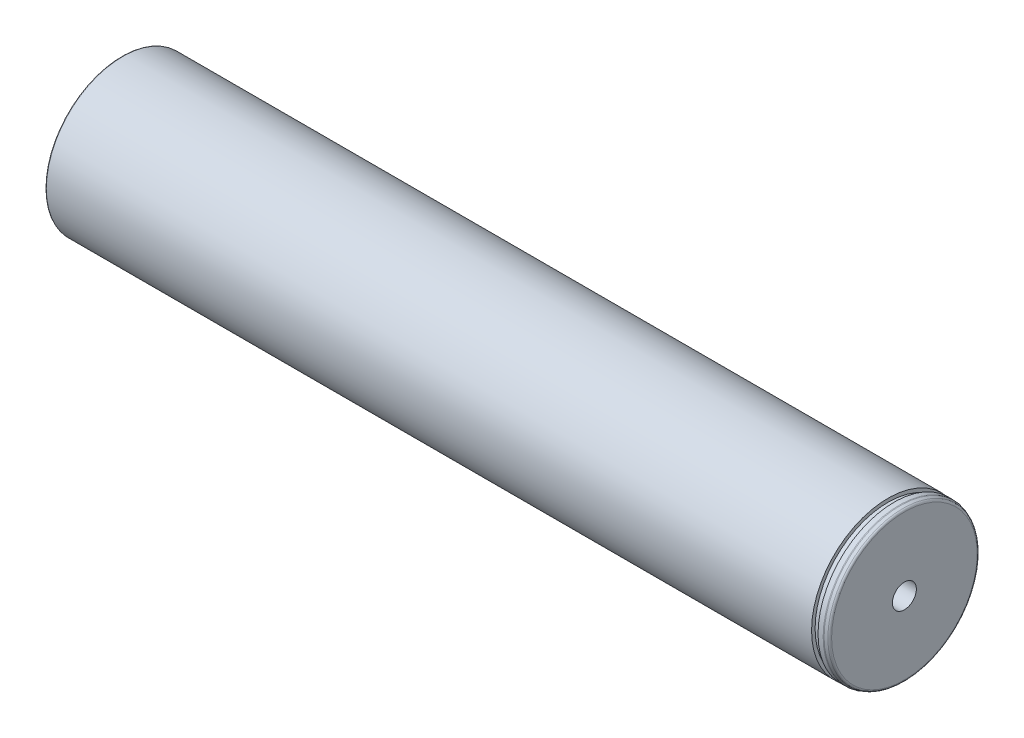
ISO-10303-21;
HEADER;
FILE_DESCRIPTION(('STEP AP214'),'2;1');
FILE_NAME('part.step','',(''),(''),'','','');
FILE_SCHEMA(('AUTOMOTIVE_DESIGN { 1 0 10303 214 1 1 1 1 }'));
ENDSEC;
DATA;
#1=APPLICATION_CONTEXT('core data for automotive mechanical design processes');
#2=APPLICATION_PROTOCOL_DEFINITION('international standard','automotive_design',2000,#1);
#3=PRODUCT_CONTEXT('',#1,'mechanical');
#4=PRODUCT('Part','Part','',(#3));
#5=PRODUCT_RELATED_PRODUCT_CATEGORY('part','',(#4));
#6=PRODUCT_DEFINITION_FORMATION('','',#4);
#7=PRODUCT_DEFINITION_CONTEXT('part definition',#1,'design');
#8=PRODUCT_DEFINITION('design','',#6,#7);
#9=PRODUCT_DEFINITION_SHAPE('','',#8);
#10=(LENGTH_UNIT() NAMED_UNIT(*) SI_UNIT(.MILLI.,.METRE.));
#11=(NAMED_UNIT(*) PLANE_ANGLE_UNIT() SI_UNIT($,.RADIAN.));
#12=(NAMED_UNIT(*) SI_UNIT($,.STERADIAN.) SOLID_ANGLE_UNIT());
#13=UNCERTAINTY_MEASURE_WITH_UNIT(LENGTH_MEASURE(1.E-05),#10,'distance_accuracy_value','');
#14=(GEOMETRIC_REPRESENTATION_CONTEXT(3) GLOBAL_UNCERTAINTY_ASSIGNED_CONTEXT((#13)) GLOBAL_UNIT_ASSIGNED_CONTEXT((#10,
#11,#12)) REPRESENTATION_CONTEXT('',''));
#15=CARTESIAN_POINT('',(0.,0.,0.));
#16=DIRECTION('',(0.,0.,1.));
#17=DIRECTION('',(1.,0.,0.));
#18=AXIS2_PLACEMENT_3D('',#15,#16,#17);
#19=CARTESIAN_POINT('',(-163.4,2.22044604925031E-13,-1.66533453693773E-13));
#20=DIRECTION('',(-1.,0.,0.));
#21=DIRECTION('',(0.,0.,1.));
#22=AXIS2_PLACEMENT_3D('',#19,#20,#21);
#23=TOROIDAL_SURFACE('',#22,28.4000000000005,0.400000000000005);
#24=CARTESIAN_POINT('',(-163.,0.,-1.11022302462516E-13));
#25=DIRECTION('',(-1.,0.,0.));
#26=DIRECTION('',(0.,0.,1.));
#27=AXIS2_PLACEMENT_3D('',#24,#25,#26);
#28=CIRCLE('',#27,28.4000000000005);
#29=CARTESIAN_POINT('',(-163.,0.,28.4000000000004));
#30=VERTEX_POINT('',#29);
#31=EDGE_CURVE('E110',#30,#30,#28,.T.);
#32=ORIENTED_EDGE('',*,*,#31,.T.);
#33=EDGE_LOOP('',(#32));
#34=FACE_BOUND('',#33,.T.);
#35=CARTESIAN_POINT('',(-163.4,2.22044604925031E-13,-1.66533453693773E-13));
#36=DIRECTION('',(-1.,0.,0.));
#37=DIRECTION('',(0.,0.,1.));
#38=AXIS2_PLACEMENT_3D('',#35,#36,#37);
#39=CIRCLE('',#38,28.0000000000005);
#40=CARTESIAN_POINT('',(-163.4,2.20490292690556E-13,28.0000000000004));
#41=VERTEX_POINT('',#40);
#42=EDGE_CURVE('E11',#41,#41,#39,.T.);
#43=ORIENTED_EDGE('',*,*,#42,.F.);
#44=EDGE_LOOP('',(#43));
#45=FACE_BOUND('',#44,.T.);
#46=ADVANCED_FACE('F47',(#34,#45),#23,.F.);
#47=CARTESIAN_POINT('',(-168.,0.,-1.11022302462516E-13));
#48=DIRECTION('',(-1.,0.,0.));
#49=DIRECTION('',(0.,0.,1.));
#50=AXIS2_PLACEMENT_3D('',#47,#48,#49);
#51=CYLINDRICAL_SURFACE('',#50,28.0000000000005);
#52=CARTESIAN_POINT('',(-164.,0.,-1.11022302462516E-13));
#53=DIRECTION('',(-1.,0.,0.));
#54=DIRECTION('',(0.,0.,1.));
#55=AXIS2_PLACEMENT_3D('',#52,#53,#54);
#56=CIRCLE('',#55,28.0000000000005);
#57=CARTESIAN_POINT('',(-164.,0.,28.0000000000004));
#58=VERTEX_POINT('',#57);
#59=EDGE_CURVE('E54',#58,#58,#56,.T.);
#60=ORIENTED_EDGE('',*,*,#59,.F.);
#61=EDGE_LOOP('',(#60));
#62=FACE_BOUND('',#61,.T.);
#63=ORIENTED_EDGE('',*,*,#42,.T.);
#64=EDGE_LOOP('',(#63));
#65=FACE_BOUND('',#64,.T.);
#66=ADVANCED_FACE('F99',(#62,#65),#51,.T.);
#67=CARTESIAN_POINT('',(-164.,28.0000000000007,-3.33066907387547E-13));
#68=DIRECTION('',(1.,0.,0.));
#69=DIRECTION('',(0.,0.,-1.));
#70=AXIS2_PLACEMENT_3D('',#67,#68,#69);
#71=PLANE('',#70);
#72=CARTESIAN_POINT('',(-164.,0.,-1.11022302462516E-13));
#73=DIRECTION('',(-1.,0.,0.));
#74=DIRECTION('',(0.,0.,1.));
#75=AXIS2_PLACEMENT_3D('',#72,#73,#74);
#76=CIRCLE('',#75,25.2309401076756);
#77=CARTESIAN_POINT('',(-164.,0.,25.2309401076755));
#78=VERTEX_POINT('',#77);
#79=EDGE_CURVE('E92',#78,#78,#76,.T.);
#80=ORIENTED_EDGE('',*,*,#79,.F.);
#81=EDGE_LOOP('',(#80));
#82=FACE_BOUND('',#81,.T.);
#83=ORIENTED_EDGE('',*,*,#59,.T.);
#84=EDGE_LOOP('',(#83));
#85=FACE_BOUND('',#84,.T.);
#86=ADVANCED_FACE('F97',(#82,#85),#71,.F.);
#87=CARTESIAN_POINT('',(-164.4,0.,-1.11022302462516E-13));
#88=DIRECTION('',(-1.,0.,0.));
#89=DIRECTION('',(0.,0.,1.));
#90=AXIS2_PLACEMENT_3D('',#87,#88,#89);
#91=TOROIDAL_SURFACE('',#90,25.2309401076756,0.399999999999999);
#92=ORIENTED_EDGE('',*,*,#79,.T.);
#93=EDGE_LOOP('',(#92));
#94=FACE_BOUND('',#93,.T.);
#95=CARTESIAN_POINT('',(-164.2,2.22044604925031E-13,-1.66533453693773E-13));
#96=DIRECTION('',(-1.,0.,0.));
#97=DIRECTION('',(0.,0.,1.));
#98=AXIS2_PLACEMENT_3D('',#95,#96,#97);
#99=CIRCLE('',#98,24.884529946162);
#100=CARTESIAN_POINT('',(-164.2,2.20663236019871E-13,24.8845299461618));
#101=VERTEX_POINT('',#100);
#102=EDGE_CURVE('E89',#101,#101,#99,.T.);
#103=ORIENTED_EDGE('',*,*,#102,.F.);
#104=EDGE_LOOP('',(#103));
#105=FACE_BOUND('',#104,.T.);
#106=ADVANCED_FACE('F177',(#94,#105),#91,.F.);
#107=CARTESIAN_POINT('',(-164.2,2.22044604925031E-13,-1.66533453693773E-13));
#108=DIRECTION('',(1.,0.,0.));
#109=DIRECTION('',(0.,0.,-1.));
#110=AXIS2_PLACEMENT_3D('',#107,#108,#109);
#111=CONICAL_SURFACE('',#110,24.884529946162,0.523598775599148);
#112=CARTESIAN_POINT('',(-167.8,0.,-1.11022302462516E-13));
#113=DIRECTION('',(-1.,0.,0.));
#114=DIRECTION('',(0.,0.,1.));
#115=AXIS2_PLACEMENT_3D('',#112,#113,#114);
#116=CIRCLE('',#115,22.8060689770749);
#117=CARTESIAN_POINT('',(-167.8,0.,22.8060689770748));
#118=VERTEX_POINT('',#117);
#119=EDGE_CURVE('E86',#118,#118,#116,.T.);
#120=ORIENTED_EDGE('',*,*,#119,.F.);
#121=EDGE_LOOP('',(#120));
#122=FACE_BOUND('',#121,.T.);
#123=ORIENTED_EDGE('',*,*,#102,.T.);
#124=EDGE_LOOP('',(#123));
#125=FACE_BOUND('',#124,.T.);
#126=ADVANCED_FACE('F173',(#122,#125),#111,.T.);
#127=CARTESIAN_POINT('',(-167.6,2.22044604925031E-13,-1.66533453693773E-13));
#128=DIRECTION('',(-1.,0.,0.));
#129=DIRECTION('',(0.,0.,1.));
#130=AXIS2_PLACEMENT_3D('',#127,#128,#129);
#131=TOROIDAL_SURFACE('',#130,22.4596588155613,0.400000000000012);
#132=CARTESIAN_POINT('',(-168.,0.,-1.11022302462516E-13));
#133=DIRECTION('',(-1.,0.,0.));
#134=DIRECTION('',(0.,0.,1.));
#135=AXIS2_PLACEMENT_3D('',#132,#133,#134);
#136=CIRCLE('',#135,22.4596588155613);
#137=CARTESIAN_POINT('',(-168.,0.,22.4596588155612));
#138=VERTEX_POINT('',#137);
#139=EDGE_CURVE('E83',#138,#138,#136,.T.);
#140=ORIENTED_EDGE('',*,*,#139,.F.);
#141=EDGE_LOOP('',(#140));
#142=FACE_BOUND('',#141,.T.);
#143=ORIENTED_EDGE('',*,*,#119,.T.);
#144=EDGE_LOOP('',(#143));
#145=FACE_BOUND('',#144,.T.);
#146=ADVANCED_FACE('F169',(#142,#145),#131,.T.);
#147=CARTESIAN_POINT('',(-168.,22.4596588155612,-1.66533453693773E-13));
#148=DIRECTION('',(1.,0.,0.));
#149=DIRECTION('',(0.,0.,-1.));
#150=AXIS2_PLACEMENT_3D('',#147,#148,#149);
#151=PLANE('',#150);
#152=CARTESIAN_POINT('',(-168.,0.,-1.11022302462516E-13));
#153=DIRECTION('',(-1.,0.,0.));
#154=DIRECTION('',(0.,0.,1.));
#155=AXIS2_PLACEMENT_3D('',#152,#153,#154);
#156=CIRCLE('',#155,5.1);
#157=CARTESIAN_POINT('',(-168.,0.,5.09999999999989));
#158=VERTEX_POINT('',#157);
#159=EDGE_CURVE('E74',#158,#158,#156,.T.);
#160=ORIENTED_EDGE('',*,*,#159,.F.);
#161=EDGE_LOOP('',(#160));
#162=FACE_BOUND('',#161,.T.);
#163=ORIENTED_EDGE('',*,*,#139,.T.);
#164=EDGE_LOOP('',(#163));
#165=FACE_BOUND('',#164,.T.);
#166=ADVANCED_FACE('F165',(#162,#165),#151,.F.);
#167=CARTESIAN_POINT('',(-168.,0.,-1.11022302462516E-13));
#168=DIRECTION('',(-1.,0.,0.));
#169=DIRECTION('',(0.,0.,1.));
#170=AXIS2_PLACEMENT_3D('',#167,#168,#169);
#171=CYLINDRICAL_SURFACE('',#170,5.1);
#172=CARTESIAN_POINT('',(-148.,0.,-1.11022302462516E-13));
#173=DIRECTION('',(-1.,0.,0.));
#174=DIRECTION('',(0.,0.,1.));
#175=AXIS2_PLACEMENT_3D('',#172,#173,#174);
#176=CIRCLE('',#175,5.1);
#177=CARTESIAN_POINT('',(-148.,0.,5.09999999999989));
#178=VERTEX_POINT('',#177);
#179=EDGE_CURVE('E70',#178,#178,#176,.T.);
#180=ORIENTED_EDGE('',*,*,#179,.F.);
#181=EDGE_LOOP('',(#180));
#182=FACE_BOUND('',#181,.T.);
#183=ORIENTED_EDGE('',*,*,#159,.T.);
#184=EDGE_LOOP('',(#183));
#185=FACE_BOUND('',#184,.T.);
#186=ADVANCED_FACE('F162',(#182,#185),#171,.F.);
#187=CARTESIAN_POINT('',(-148.,0.,-1.11022302462516E-13));
#188=DIRECTION('',(-1.,0.,0.));
#189=DIRECTION('',(0.,0.,1.));
#190=AXIS2_PLACEMENT_3D('',#187,#188,#189);
#191=CONICAL_SURFACE('',#190,5.1,1.0471975511966);
#192=CARTESIAN_POINT('',(-145.055513627133,0.,0.));
#193=VERTEX_POINT('',#192);
#194=VERTEX_LOOP('',#193);
#195=FACE_BOUND('',#194,.T.);
#196=ORIENTED_EDGE('',*,*,#179,.T.);
#197=EDGE_LOOP('',(#196));
#198=FACE_BOUND('',#197,.T.);
#199=ADVANCED_FACE('F64',(#195,#198),#191,.F.);
#200=CARTESIAN_POINT('',(150.,0.,-1.11022302462516E-13));
#201=DIRECTION('',(1.,0.,0.));
#202=DIRECTION('',(0.,0.,-1.));
#203=AXIS2_PLACEMENT_3D('',#200,#201,#202);
#204=CONICAL_SURFACE('',#203,5.1,1.04719755119659);
#205=CARTESIAN_POINT('',(147.055513627133,0.,0.));
#206=VERTEX_POINT('',#205);
#207=VERTEX_LOOP('',#206);
#208=FACE_BOUND('',#207,.T.);
#209=CARTESIAN_POINT('',(150.,0.,-1.11022302462516E-13));
#210=DIRECTION('',(-1.,0.,0.));
#211=DIRECTION('',(0.,0.,1.));
#212=AXIS2_PLACEMENT_3D('',#209,#210,#211);
#213=CIRCLE('',#212,5.1);
#214=CARTESIAN_POINT('',(150.,0.,5.09999999999989));
#215=VERTEX_POINT('',#214);
#216=EDGE_CURVE('E68',#215,#215,#213,.T.);
#217=ORIENTED_EDGE('',*,*,#216,.F.);
#218=EDGE_LOOP('',(#217));
#219=FACE_BOUND('',#218,.T.);
#220=ADVANCED_FACE('F60',(#208,#219),#204,.F.);
#221=CARTESIAN_POINT('',(-168.,0.,-1.11022302462516E-13));
#222=DIRECTION('',(-1.,0.,0.));
#223=DIRECTION('',(0.,0.,1.));
#224=AXIS2_PLACEMENT_3D('',#221,#222,#223);
#225=CYLINDRICAL_SURFACE('',#224,5.1);
#226=ORIENTED_EDGE('',*,*,#216,.T.);
#227=EDGE_LOOP('',(#226));
#228=FACE_BOUND('',#227,.T.);
#229=CARTESIAN_POINT('',(170.,0.,-1.11022302462516E-13));
#230=DIRECTION('',(-1.,0.,0.));
#231=DIRECTION('',(0.,0.,1.));
#232=AXIS2_PLACEMENT_3D('',#229,#230,#231);
#233=CIRCLE('',#232,5.1);
#234=CARTESIAN_POINT('',(170.,0.,5.09999999999989));
#235=VERTEX_POINT('',#234);
#236=EDGE_CURVE('E71',#235,#235,#233,.T.);
#237=ORIENTED_EDGE('',*,*,#236,.F.);
#238=EDGE_LOOP('',(#237));
#239=FACE_BOUND('',#238,.T.);
#240=ADVANCED_FACE('F63',(#228,#239),#225,.F.);
#241=CARTESIAN_POINT('',(170.,30.971851993258,-3.88578058618805E-13));
#242=DIRECTION('',(1.,0.,0.));
#243=DIRECTION('',(0.,0.,-1.));
#244=AXIS2_PLACEMENT_3D('',#241,#242,#243);
#245=PLANE('',#244);
#246=ORIENTED_EDGE('',*,*,#236,.T.);
#247=EDGE_LOOP('',(#246));
#248=FACE_BOUND('',#247,.T.);
#249=CARTESIAN_POINT('',(170.,0.,-1.11022302462516E-13));
#250=DIRECTION('',(-1.,0.,0.));
#251=DIRECTION('',(0.,0.,1.));
#252=AXIS2_PLACEMENT_3D('',#249,#250,#251);
#253=CIRCLE('',#252,30.9718519932579);
#254=CARTESIAN_POINT('',(170.,0.,30.9718519932578));
#255=VERTEX_POINT('',#254);
#256=EDGE_CURVE('E77',#255,#255,#253,.T.);
#257=ORIENTED_EDGE('',*,*,#256,.F.);
#258=EDGE_LOOP('',(#257));
#259=FACE_BOUND('',#258,.T.);
#260=ADVANCED_FACE('F145',(#248,#259),#245,.T.);
#261=CARTESIAN_POINT('',(169.,-2.22044604925031E-13,-4.9960036108132E-13));
#262=DIRECTION('',(-1.,0.,0.));
#263=DIRECTION('',(0.,0.,1.));
#264=AXIS2_PLACEMENT_3D('',#261,#262,#263);
#265=TOROIDAL_SURFACE('',#264,30.9718519932579,0.999999999999993);
#266=CARTESIAN_POINT('',(169.342020143326,0.,-1.11022302462516E-13));
#267=DIRECTION('',(-1.,0.,0.));
#268=DIRECTION('',(0.,0.,1.));
#269=AXIS2_PLACEMENT_3D('',#266,#267,#268);
#270=CIRCLE('',#269,31.9115446140438);
#271=CARTESIAN_POINT('',(169.342020143326,0.,31.9115446140437));
#272=VERTEX_POINT('',#271);
#273=EDGE_CURVE('E138',#272,#272,#270,.T.);
#274=ORIENTED_EDGE('',*,*,#273,.F.);
#275=EDGE_LOOP('',(#274));
#276=FACE_BOUND('',#275,.T.);
#277=ORIENTED_EDGE('',*,*,#256,.T.);
#278=EDGE_LOOP('',(#277));
#279=FACE_BOUND('',#278,.T.);
#280=ADVANCED_FACE('F143',(#276,#279),#265,.T.);
#281=CARTESIAN_POINT('',(169.342020143326,0.,-1.11022302462516E-13));
#282=DIRECTION('',(-1.,0.,0.));
#283=DIRECTION('',(0.,0.,1.));
#284=AXIS2_PLACEMENT_3D('',#281,#282,#283);
#285=CONICAL_SURFACE('',#284,31.9115446140438,0.349065850398858);
#286=CARTESIAN_POINT('',(168.165693162617,0.,-1.11022302462516E-13));
#287=DIRECTION('',(-1.,0.,0.));
#288=DIRECTION('',(0.,0.,1.));
#289=AXIS2_PLACEMENT_3D('',#286,#287,#288);
#290=CIRCLE('',#289,32.3396926207859);
#291=CARTESIAN_POINT('',(168.165693162617,0.,32.3396926207858));
#292=VERTEX_POINT('',#291);
#293=EDGE_CURVE('E135',#292,#292,#290,.T.);
#294=ORIENTED_EDGE('',*,*,#293,.F.);
#295=EDGE_LOOP('',(#294));
#296=FACE_BOUND('',#295,.T.);
#297=ORIENTED_EDGE('',*,*,#273,.T.);
#298=EDGE_LOOP('',(#297));
#299=FACE_BOUND('',#298,.T.);
#300=ADVANCED_FACE('F153',(#296,#299),#285,.T.);
#301=CARTESIAN_POINT('',(167.823673019291,0.,0.));
#302=DIRECTION('',(-1.,0.,0.));
#303=DIRECTION('',(0.,0.,1.));
#304=AXIS2_PLACEMENT_3D('',#301,#302,#303);
#305=TOROIDAL_SURFACE('',#304,31.4,0.999999999999996);
#306=ORIENTED_EDGE('',*,*,#293,.T.);
#307=EDGE_LOOP('',(#306));
#308=FACE_BOUND('',#307,.T.);
#309=CARTESIAN_POINT('',(167.823673019291,0.,0.));
#310=DIRECTION('',(-1.,0.,0.));
#311=DIRECTION('',(0.,0.,1.));
#312=AXIS2_PLACEMENT_3D('',#309,#310,#311);
#313=CIRCLE('',#312,32.4);
#314=CARTESIAN_POINT('',(167.823673019291,0.,32.4));
#315=VERTEX_POINT('',#314);
#316=EDGE_CURVE('E132',#315,#315,#313,.T.);
#317=ORIENTED_EDGE('',*,*,#316,.F.);
#318=EDGE_LOOP('',(#317));
#319=FACE_BOUND('',#318,.T.);
#320=ADVANCED_FACE('F252',(#308,#319),#305,.T.);
#321=CARTESIAN_POINT('',(-168.,0.,-1.11022302462516E-13));
#322=DIRECTION('',(-1.,0.,0.));
#323=DIRECTION('',(0.,0.,1.));
#324=AXIS2_PLACEMENT_3D('',#321,#322,#323);
#325=CYLINDRICAL_SURFACE('',#324,32.4);
#326=ORIENTED_EDGE('',*,*,#316,.T.);
#327=EDGE_LOOP('',(#326));
#328=FACE_BOUND('',#327,.T.);
#329=CARTESIAN_POINT('',(165.65,-2.22044604925031E-13,-1.66533453693773E-13));
#330=DIRECTION('',(-1.,0.,0.));
#331=DIRECTION('',(0.,0.,1.));
#332=AXIS2_PLACEMENT_3D('',#329,#330,#331);
#333=CIRCLE('',#332,32.4);
#334=CARTESIAN_POINT('',(165.65,-2.23843166224924E-13,32.3999999999998));
#335=VERTEX_POINT('',#334);
#336=EDGE_CURVE('E129',#335,#335,#333,.T.);
#337=ORIENTED_EDGE('',*,*,#336,.F.);
#338=EDGE_LOOP('',(#337));
#339=FACE_BOUND('',#338,.T.);
#340=ADVANCED_FACE('F259',(#328,#339),#325,.T.);
#341=CARTESIAN_POINT('',(165.65,30.9999999999999,0.));
#342=DIRECTION('',(-1.,0.,0.));
#343=DIRECTION('',(0.,0.,1.));
#344=AXIS2_PLACEMENT_3D('',#341,#342,#343);
#345=PLANE('',#344);
#346=ORIENTED_EDGE('',*,*,#336,.T.);
#347=EDGE_LOOP('',(#346));
#348=FACE_BOUND('',#347,.T.);
#349=CARTESIAN_POINT('',(165.65,-2.22044604925031E-13,-1.66533453693773E-13));
#350=DIRECTION('',(-1.,0.,0.));
#351=DIRECTION('',(0.,0.,1.));
#352=AXIS2_PLACEMENT_3D('',#349,#350,#351);
#353=CIRCLE('',#352,31.);
#354=CARTESIAN_POINT('',(165.65,-2.237654506132E-13,30.9999999999998));
#355=VERTEX_POINT('',#354);
#356=EDGE_CURVE('E126',#355,#355,#353,.T.);
#357=ORIENTED_EDGE('',*,*,#356,.F.);
#358=EDGE_LOOP('',(#357));
#359=FACE_BOUND('',#358,.T.);
#360=ADVANCED_FACE('F267',(#348,#359),#345,.T.);
#361=CARTESIAN_POINT('',(-168.,0.,-1.11022302462516E-13));
#362=DIRECTION('',(-1.,0.,0.));
#363=DIRECTION('',(0.,0.,1.));
#364=AXIS2_PLACEMENT_3D('',#361,#362,#363);
#365=CYLINDRICAL_SURFACE('',#364,31.);
#366=ORIENTED_EDGE('',*,*,#356,.T.);
#367=EDGE_LOOP('',(#366));
#368=FACE_BOUND('',#367,.T.);
#369=CARTESIAN_POINT('',(163.,0.,-1.11022302462516E-13));
#370=DIRECTION('',(-1.,0.,0.));
#371=DIRECTION('',(0.,0.,1.));
#372=AXIS2_PLACEMENT_3D('',#369,#370,#371);
#373=CIRCLE('',#372,31.);
#374=CARTESIAN_POINT('',(163.,0.,30.9999999999999));
#375=VERTEX_POINT('',#374);
#376=EDGE_CURVE('E123',#375,#375,#373,.T.);
#377=ORIENTED_EDGE('',*,*,#376,.F.);
#378=EDGE_LOOP('',(#377));
#379=FACE_BOUND('',#378,.T.);
#380=ADVANCED_FACE('F275',(#368,#379),#365,.T.);
#381=CARTESIAN_POINT('',(163.,32.4999999999993,-4.9960036108132E-13));
#382=DIRECTION('',(1.,0.,0.));
#383=DIRECTION('',(0.,0.,-1.));
#384=AXIS2_PLACEMENT_3D('',#381,#382,#383);
#385=PLANE('',#384);
#386=ORIENTED_EDGE('',*,*,#376,.T.);
#387=EDGE_LOOP('',(#386));
#388=FACE_BOUND('',#387,.T.);
#389=CARTESIAN_POINT('',(163.,0.,-1.11022302462516E-13));
#390=DIRECTION('',(-1.,0.,0.));
#391=DIRECTION('',(0.,0.,1.));
#392=AXIS2_PLACEMENT_3D('',#389,#390,#391);
#393=CIRCLE('',#392,32.5);
#394=CARTESIAN_POINT('',(163.,0.,32.4999999999999));
#395=VERTEX_POINT('',#394);
#396=EDGE_CURVE('E120',#395,#395,#393,.T.);
#397=ORIENTED_EDGE('',*,*,#396,.F.);
#398=EDGE_LOOP('',(#397));
#399=FACE_BOUND('',#398,.T.);
#400=ADVANCED_FACE('F283',(#388,#399),#385,.T.);
#401=CARTESIAN_POINT('',(-168.,0.,-1.11022302462516E-13));
#402=DIRECTION('',(-1.,0.,0.));
#403=DIRECTION('',(0.,0.,1.));
#404=AXIS2_PLACEMENT_3D('',#401,#402,#403);
#405=CYLINDRICAL_SURFACE('',#404,32.5);
#406=CARTESIAN_POINT('',(-162.6,0.,-1.11022302462516E-13));
#407=DIRECTION('',(-1.,0.,0.));
#408=DIRECTION('',(0.,0.,1.));
#409=AXIS2_PLACEMENT_3D('',#406,#407,#408);
#410=CIRCLE('',#409,32.5);
#411=CARTESIAN_POINT('',(-162.6,0.,32.4999999999998));
#412=VERTEX_POINT('',#411);
#413=EDGE_CURVE('E115',#412,#412,#410,.T.);
#414=ORIENTED_EDGE('',*,*,#413,.F.);
#415=EDGE_LOOP('',(#414));
#416=FACE_BOUND('',#415,.T.);
#417=ORIENTED_EDGE('',*,*,#396,.T.);
#418=EDGE_LOOP('',(#417));
#419=FACE_BOUND('',#418,.T.);
#420=ADVANCED_FACE('F291',(#416,#419),#405,.T.);
#421=CARTESIAN_POINT('',(-162.6,0.,-1.11022302462516E-13));
#422=DIRECTION('',(-1.,0.,0.));
#423=DIRECTION('',(0.,0.,1.));
#424=AXIS2_PLACEMENT_3D('',#421,#422,#423);
#425=TOROIDAL_SURFACE('',#424,32.1,0.400000000000001);
#426=ORIENTED_EDGE('',*,*,#413,.T.);
#427=EDGE_LOOP('',(#426));
#428=FACE_BOUND('',#427,.T.);
#429=CARTESIAN_POINT('',(-163.,0.,-1.11022302462516E-13));
#430=DIRECTION('',(-1.,0.,0.));
#431=DIRECTION('',(0.,0.,1.));
#432=AXIS2_PLACEMENT_3D('',#429,#430,#431);
#433=CIRCLE('',#432,32.1);
#434=CARTESIAN_POINT('',(-163.,0.,32.0999999999999));
#435=VERTEX_POINT('',#434);
#436=EDGE_CURVE('E112',#435,#435,#433,.T.);
#437=ORIENTED_EDGE('',*,*,#436,.F.);
#438=EDGE_LOOP('',(#437));
#439=FACE_BOUND('',#438,.T.);
#440=ADVANCED_FACE('F299',(#428,#439),#425,.T.);
#441=CARTESIAN_POINT('',(-163.,32.1,0.));
#442=DIRECTION('',(1.,0.,0.));
#443=DIRECTION('',(0.,0.,-1.));
#444=AXIS2_PLACEMENT_3D('',#441,#442,#443);
#445=PLANE('',#444);
#446=ORIENTED_EDGE('',*,*,#31,.F.);
#447=EDGE_LOOP('',(#446));
#448=FACE_BOUND('',#447,.T.);
#449=ORIENTED_EDGE('',*,*,#436,.T.);
#450=EDGE_LOOP('',(#449));
#451=FACE_BOUND('',#450,.T.);
#452=ADVANCED_FACE('F310',(#448,#451),#445,.F.);
#453=CLOSED_SHELL('',(#46,#66,#86,#106,#126,#146,#166,#186,#199,#220,#240,#260,#280,#300,#320,
#340,#360,#380,#400,#420,#440,#452));
#454=MANIFOLD_SOLID_BREP('B2',#453);
#455=ADVANCED_BREP_SHAPE_REPRESENTATION('',(#18,#454),#14);
#456=SHAPE_DEFINITION_REPRESENTATION(#9,#455);
ENDSEC;
END-ISO-10303-21;
